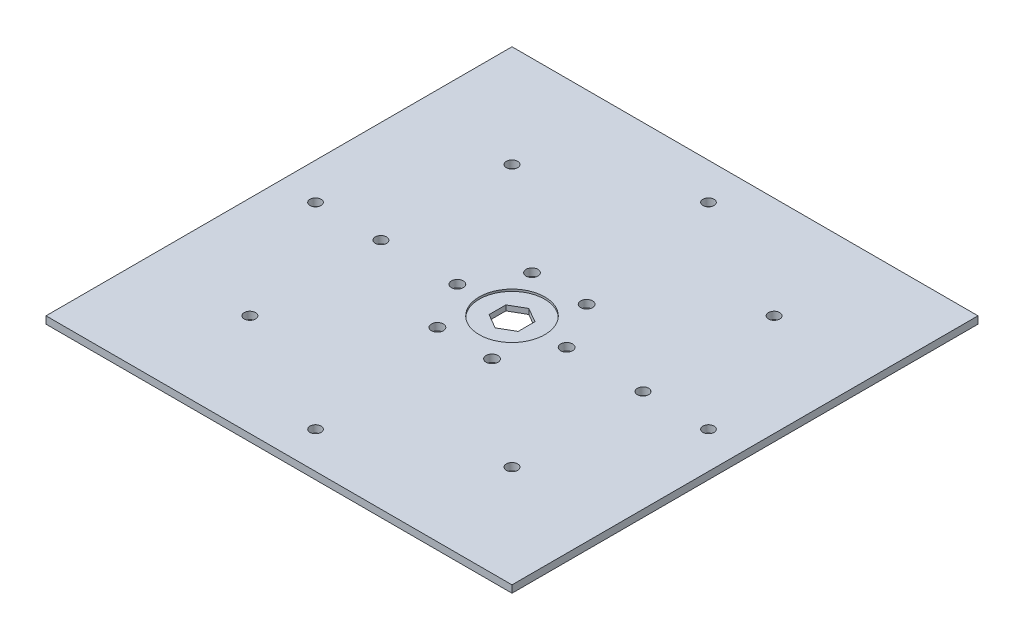
ISO-10303-21;
HEADER;
FILE_DESCRIPTION(('STEP AP214'),'2;1');
FILE_NAME('part.step','',(''),(''),'','','');
FILE_SCHEMA(('AUTOMOTIVE_DESIGN { 1 0 10303 214 1 1 1 1 }'));
ENDSEC;
DATA;
#1=APPLICATION_CONTEXT('core data for automotive mechanical design processes');
#2=APPLICATION_PROTOCOL_DEFINITION('international standard','automotive_design',2000,#1);
#3=PRODUCT_CONTEXT('',#1,'mechanical');
#4=PRODUCT('Part','Part','',(#3));
#5=PRODUCT_RELATED_PRODUCT_CATEGORY('part','',(#4));
#6=PRODUCT_DEFINITION_FORMATION('','',#4);
#7=PRODUCT_DEFINITION_CONTEXT('part definition',#1,'design');
#8=PRODUCT_DEFINITION('design','',#6,#7);
#9=PRODUCT_DEFINITION_SHAPE('','',#8);
#10=(LENGTH_UNIT() NAMED_UNIT(*) SI_UNIT(.MILLI.,.METRE.));
#11=(NAMED_UNIT(*) PLANE_ANGLE_UNIT() SI_UNIT($,.RADIAN.));
#12=(NAMED_UNIT(*) SI_UNIT($,.STERADIAN.) SOLID_ANGLE_UNIT());
#13=UNCERTAINTY_MEASURE_WITH_UNIT(LENGTH_MEASURE(1.E-05),#10,'distance_accuracy_value','');
#14=(GEOMETRIC_REPRESENTATION_CONTEXT(3) GLOBAL_UNCERTAINTY_ASSIGNED_CONTEXT((#13)) GLOBAL_UNIT_ASSIGNED_CONTEXT((#10,
#11,#12)) REPRESENTATION_CONTEXT('',''));
#15=CARTESIAN_POINT('',(0.,0.,0.));
#16=DIRECTION('',(0.,0.,1.));
#17=DIRECTION('',(1.,0.,0.));
#18=AXIS2_PLACEMENT_3D('',#15,#16,#17);
#19=CARTESIAN_POINT('',(107.95,3.175,-97.9338257906459));
#20=DIRECTION('',(-1.,0.,0.));
#21=DIRECTION('',(0.,0.,1.));
#22=AXIS2_PLACEMENT_3D('',#19,#20,#21);
#23=PLANE('',#22);
#24=DIRECTION('',(0.,-1.,0.));
#25=VECTOR('',#24,1.);
#26=CARTESIAN_POINT('',(107.95,3.175,-97.9338257906459));
#27=LINE('',#26,#25);
#28=CARTESIAN_POINT('',(107.95,2.286,-97.9338257906459));
#29=VERTEX_POINT('',#28);
#30=CARTESIAN_POINT('',(107.95,0.,-97.9338257906459));
#31=VERTEX_POINT('',#30);
#32=EDGE_CURVE('E56',#29,#31,#27,.T.);
#33=ORIENTED_EDGE('',*,*,#32,.F.);
#34=DIRECTION('',(0.,0.,-1.));
#35=VECTOR('',#34,1.);
#36=CARTESIAN_POINT('',(107.95,2.286,-97.9338257906459));
#37=LINE('',#36,#35);
#38=CARTESIAN_POINT('',(107.95,2.286,-105.266174209354));
#39=VERTEX_POINT('',#38);
#40=EDGE_CURVE('E50',#29,#39,#37,.T.);
#41=ORIENTED_EDGE('',*,*,#40,.T.);
#42=DIRECTION('',(0.,-1.,0.));
#43=VECTOR('',#42,1.);
#44=CARTESIAN_POINT('',(107.95,3.175,-105.266174209354));
#45=LINE('',#44,#43);
#46=CARTESIAN_POINT('',(107.95,0.,-105.266174209354));
#47=VERTEX_POINT('',#46);
#48=EDGE_CURVE('E137',#39,#47,#45,.T.);
#49=ORIENTED_EDGE('',*,*,#48,.T.);
#50=DIRECTION('',(0.,0.,-1.));
#51=VECTOR('',#50,1.);
#52=CARTESIAN_POINT('',(107.95,0.,-97.9338257906459));
#53=LINE('',#52,#51);
#54=EDGE_CURVE('E309',#31,#47,#53,.T.);
#55=ORIENTED_EDGE('',*,*,#54,.F.);
#56=EDGE_LOOP('',(#33,#41,#49,#55));
#57=FACE_BOUND('',#56,.T.);
#58=ADVANCED_FACE('F35',(#57),#23,.T.);
#59=CARTESIAN_POINT('',(107.95,3.175,-105.266174209354));
#60=DIRECTION('',(-0.5,0.,0.866025403784439));
#61=DIRECTION('',(0.866025403784439,0.,0.5));
#62=AXIS2_PLACEMENT_3D('',#59,#60,#61);
#63=PLANE('',#62);
#64=ORIENTED_EDGE('',*,*,#48,.F.);
#65=DIRECTION('',(-0.866025403784439,0.,-0.5));
#66=VECTOR('',#65,1.);
#67=CARTESIAN_POINT('',(107.95,2.286,-105.266174209354));
#68=LINE('',#67,#66);
#69=CARTESIAN_POINT('',(101.6,2.286,-108.932348418708));
#70=VERTEX_POINT('',#69);
#71=EDGE_CURVE('E334',#39,#70,#68,.T.);
#72=ORIENTED_EDGE('',*,*,#71,.T.);
#73=DIRECTION('',(0.,-1.,0.));
#74=VECTOR('',#73,1.);
#75=CARTESIAN_POINT('',(101.6,3.175,-108.932348418708));
#76=LINE('',#75,#74);
#77=CARTESIAN_POINT('',(101.6,0.,-108.932348418708));
#78=VERTEX_POINT('',#77);
#79=EDGE_CURVE('E135',#70,#78,#76,.T.);
#80=ORIENTED_EDGE('',*,*,#79,.T.);
#81=DIRECTION('',(-0.866025403784439,0.,-0.5));
#82=VECTOR('',#81,1.);
#83=CARTESIAN_POINT('',(107.95,0.,-105.266174209354));
#84=LINE('',#83,#82);
#85=EDGE_CURVE('E314',#47,#78,#84,.T.);
#86=ORIENTED_EDGE('',*,*,#85,.F.);
#87=EDGE_LOOP('',(#64,#72,#80,#86));
#88=FACE_BOUND('',#87,.T.);
#89=ADVANCED_FACE('F343',(#88),#63,.T.);
#90=CARTESIAN_POINT('',(101.6,3.175,-108.932348418708));
#91=DIRECTION('',(0.499999999999998,0.,0.86602540378444));
#92=DIRECTION('',(0.86602540378444,0.,-0.499999999999998));
#93=AXIS2_PLACEMENT_3D('',#90,#91,#92);
#94=PLANE('',#93);
#95=ORIENTED_EDGE('',*,*,#79,.F.);
#96=DIRECTION('',(-0.86602540378444,0.,0.499999999999998));
#97=VECTOR('',#96,1.);
#98=CARTESIAN_POINT('',(101.6,2.286,-108.932348418708));
#99=LINE('',#98,#97);
#100=CARTESIAN_POINT('',(95.25,2.286,-105.266174209354));
#101=VERTEX_POINT('',#100);
#102=EDGE_CURVE('E332',#70,#101,#99,.T.);
#103=ORIENTED_EDGE('',*,*,#102,.T.);
#104=DIRECTION('',(0.,-1.,0.));
#105=VECTOR('',#104,1.);
#106=CARTESIAN_POINT('',(95.25,3.175,-105.266174209354));
#107=LINE('',#106,#105);
#108=CARTESIAN_POINT('',(95.25,0.,-105.266174209354));
#109=VERTEX_POINT('',#108);
#110=EDGE_CURVE('E129',#101,#109,#107,.T.);
#111=ORIENTED_EDGE('',*,*,#110,.T.);
#112=DIRECTION('',(-0.86602540378444,0.,0.499999999999998));
#113=VECTOR('',#112,1.);
#114=CARTESIAN_POINT('',(101.6,0.,-108.932348418708));
#115=LINE('',#114,#113);
#116=EDGE_CURVE('E317',#78,#109,#115,.T.);
#117=ORIENTED_EDGE('',*,*,#116,.F.);
#118=EDGE_LOOP('',(#95,#103,#111,#117));
#119=FACE_BOUND('',#118,.T.);
#120=ADVANCED_FACE('F345',(#119),#94,.T.);
#121=CARTESIAN_POINT('',(95.25,3.175,-105.266174209354));
#122=DIRECTION('',(1.,0.,0.));
#123=DIRECTION('',(0.,0.,-1.));
#124=AXIS2_PLACEMENT_3D('',#121,#122,#123);
#125=PLANE('',#124);
#126=ORIENTED_EDGE('',*,*,#110,.F.);
#127=DIRECTION('',(0.,0.,1.));
#128=VECTOR('',#127,1.);
#129=CARTESIAN_POINT('',(95.25,2.286,-105.266174209354));
#130=LINE('',#129,#128);
#131=CARTESIAN_POINT('',(95.25,2.286,-97.9338257906459));
#132=VERTEX_POINT('',#131);
#133=EDGE_CURVE('E121',#101,#132,#130,.T.);
#134=ORIENTED_EDGE('',*,*,#133,.T.);
#135=DIRECTION('',(0.,-1.,0.));
#136=VECTOR('',#135,1.);
#137=CARTESIAN_POINT('',(95.25,3.175,-97.9338257906459));
#138=LINE('',#137,#136);
#139=CARTESIAN_POINT('',(95.25,0.,-97.9338257906459));
#140=VERTEX_POINT('',#139);
#141=EDGE_CURVE('E120',#132,#140,#138,.T.);
#142=ORIENTED_EDGE('',*,*,#141,.T.);
#143=DIRECTION('',(0.,0.,1.));
#144=VECTOR('',#143,1.);
#145=CARTESIAN_POINT('',(95.25,0.,-105.266174209354));
#146=LINE('',#145,#144);
#147=EDGE_CURVE('E320',#109,#140,#146,.T.);
#148=ORIENTED_EDGE('',*,*,#147,.F.);
#149=EDGE_LOOP('',(#126,#134,#142,#148));
#150=FACE_BOUND('',#149,.T.);
#151=ADVANCED_FACE('F330',(#150),#125,.T.);
#152=CARTESIAN_POINT('',(95.25,3.175,-97.9338257906459));
#153=DIRECTION('',(0.499999999999998,0.,-0.86602540378444));
#154=DIRECTION('',(-0.86602540378444,0.,-0.499999999999998));
#155=AXIS2_PLACEMENT_3D('',#152,#153,#154);
#156=PLANE('',#155);
#157=ORIENTED_EDGE('',*,*,#141,.F.);
#158=DIRECTION('',(0.86602540378444,0.,0.499999999999998));
#159=VECTOR('',#158,1.);
#160=CARTESIAN_POINT('',(95.25,2.286,-97.9338257906459));
#161=LINE('',#160,#159);
#162=CARTESIAN_POINT('',(101.6,2.286,-94.2676515812917));
#163=VERTEX_POINT('',#162);
#164=EDGE_CURVE('E112',#132,#163,#161,.T.);
#165=ORIENTED_EDGE('',*,*,#164,.T.);
#166=DIRECTION('',(0.,-1.,0.));
#167=VECTOR('',#166,1.);
#168=CARTESIAN_POINT('',(101.6,3.175,-94.2676515812917));
#169=LINE('',#168,#167);
#170=CARTESIAN_POINT('',(101.6,0.,-94.2676515812917));
#171=VERTEX_POINT('',#170);
#172=EDGE_CURVE('E119',#163,#171,#169,.T.);
#173=ORIENTED_EDGE('',*,*,#172,.T.);
#174=DIRECTION('',(0.86602540378444,0.,0.499999999999998));
#175=VECTOR('',#174,1.);
#176=CARTESIAN_POINT('',(95.25,0.,-97.9338257906459));
#177=LINE('',#176,#175);
#178=EDGE_CURVE('E323',#140,#171,#177,.T.);
#179=ORIENTED_EDGE('',*,*,#178,.F.);
#180=EDGE_LOOP('',(#157,#165,#173,#179));
#181=FACE_BOUND('',#180,.T.);
#182=ADVANCED_FACE('F117',(#181),#156,.T.);
#183=CARTESIAN_POINT('',(101.6,3.175,-94.2676515812917));
#184=DIRECTION('',(-0.5,0.,-0.866025403784439));
#185=DIRECTION('',(-0.866025403784439,0.,0.5));
#186=AXIS2_PLACEMENT_3D('',#183,#184,#185);
#187=PLANE('',#186);
#188=ORIENTED_EDGE('',*,*,#172,.F.);
#189=DIRECTION('',(0.866025403784439,0.,-0.5));
#190=VECTOR('',#189,1.);
#191=CARTESIAN_POINT('',(101.6,2.286,-94.2676515812917));
#192=LINE('',#191,#190);
#193=EDGE_CURVE('E11',#163,#29,#192,.T.);
#194=ORIENTED_EDGE('',*,*,#193,.T.);
#195=ORIENTED_EDGE('',*,*,#32,.T.);
#196=DIRECTION('',(0.866025403784439,0.,-0.5));
#197=VECTOR('',#196,1.);
#198=CARTESIAN_POINT('',(101.6,0.,-94.2676515812917));
#199=LINE('',#198,#197);
#200=EDGE_CURVE('E126',#171,#31,#199,.T.);
#201=ORIENTED_EDGE('',*,*,#200,.F.);
#202=EDGE_LOOP('',(#188,#194,#195,#201));
#203=FACE_BOUND('',#202,.T.);
#204=ADVANCED_FACE('F124',(#203),#187,.T.);
#205=CARTESIAN_POINT('',(0.,3.175,0.));
#206=DIRECTION('',(0.,-1.,0.));
#207=DIRECTION('',(0.,0.,-1.));
#208=AXIS2_PLACEMENT_3D('',#205,#206,#207);
#209=PLANE('',#208);
#210=CARTESIAN_POINT('',(101.6,3.175,-101.6));
#211=DIRECTION('',(0.,1.,0.));
#212=DIRECTION('',(0.,0.,1.));
#213=AXIS2_PLACEMENT_3D('',#210,#211,#212);
#214=CIRCLE('',#213,14.2875);
#215=CARTESIAN_POINT('',(101.6,3.175,-87.3125));
#216=VERTEX_POINT('',#215);
#217=EDGE_CURVE('E618',#216,#216,#214,.T.);
#218=ORIENTED_EDGE('',*,*,#217,.F.);
#219=EDGE_LOOP('',(#218));
#220=FACE_BOUND('',#219,.T.);
#221=CARTESIAN_POINT('',(158.75,3.175,-158.75));
#222=DIRECTION('',(0.,1.,0.));
#223=DIRECTION('',(0.,0.,-1.));
#224=AXIS2_PLACEMENT_3D('',#221,#222,#223);
#225=CIRCLE('',#224,2.45744999999999);
#226=CARTESIAN_POINT('',(158.75,3.175,-161.20745));
#227=VERTEX_POINT('',#226);
#228=EDGE_CURVE('E140',#227,#227,#225,.T.);
#229=ORIENTED_EDGE('',*,*,#228,.F.);
#230=EDGE_LOOP('',(#229));
#231=FACE_BOUND('',#230,.T.);
#232=CARTESIAN_POINT('',(158.75,3.175,-101.6));
#233=DIRECTION('',(0.,1.,0.));
#234=DIRECTION('',(0.,0.,-1.));
#235=AXIS2_PLACEMENT_3D('',#232,#233,#234);
#236=CIRCLE('',#235,2.45745000000001);
#237=CARTESIAN_POINT('',(158.75,3.175,-104.05745));
#238=VERTEX_POINT('',#237);
#239=EDGE_CURVE('E146',#238,#238,#236,.T.);
#240=ORIENTED_EDGE('',*,*,#239,.F.);
#241=EDGE_LOOP('',(#240));
#242=FACE_BOUND('',#241,.T.);
#243=CARTESIAN_POINT('',(158.75,3.175,-44.45));
#244=DIRECTION('',(0.,1.,0.));
#245=DIRECTION('',(0.,0.,-1.));
#246=AXIS2_PLACEMENT_3D('',#243,#244,#245);
#247=CIRCLE('',#246,2.45744999999998);
#248=CARTESIAN_POINT('',(158.75,3.175,-46.90745));
#249=VERTEX_POINT('',#248);
#250=EDGE_CURVE('E152',#249,#249,#247,.T.);
#251=ORIENTED_EDGE('',*,*,#250,.F.);
#252=EDGE_LOOP('',(#251));
#253=FACE_BOUND('',#252,.T.);
#254=CARTESIAN_POINT('',(44.45,3.175,-44.45));
#255=DIRECTION('',(0.,1.,0.));
#256=DIRECTION('',(0.,0.,1.));
#257=AXIS2_PLACEMENT_3D('',#254,#255,#256);
#258=CIRCLE('',#257,2.45745);
#259=CARTESIAN_POINT('',(44.45,3.175,-41.99255));
#260=VERTEX_POINT('',#259);
#261=EDGE_CURVE('E158',#260,#260,#258,.T.);
#262=ORIENTED_EDGE('',*,*,#261,.F.);
#263=EDGE_LOOP('',(#262));
#264=FACE_BOUND('',#263,.T.);
#265=CARTESIAN_POINT('',(44.45,3.175,-101.6));
#266=DIRECTION('',(0.,1.,0.));
#267=DIRECTION('',(0.,0.,1.));
#268=AXIS2_PLACEMENT_3D('',#265,#266,#267);
#269=CIRCLE('',#268,2.45745);
#270=CARTESIAN_POINT('',(44.45,3.175,-99.14255));
#271=VERTEX_POINT('',#270);
#272=EDGE_CURVE('E164',#271,#271,#269,.T.);
#273=ORIENTED_EDGE('',*,*,#272,.F.);
#274=EDGE_LOOP('',(#273));
#275=FACE_BOUND('',#274,.T.);
#276=CARTESIAN_POINT('',(44.45,3.175,-158.75));
#277=DIRECTION('',(0.,1.,0.));
#278=DIRECTION('',(0.,0.,1.));
#279=AXIS2_PLACEMENT_3D('',#276,#277,#278);
#280=CIRCLE('',#279,2.45745);
#281=CARTESIAN_POINT('',(44.45,3.175,-156.29255));
#282=VERTEX_POINT('',#281);
#283=EDGE_CURVE('E170',#282,#282,#280,.T.);
#284=ORIENTED_EDGE('',*,*,#283,.F.);
#285=EDGE_LOOP('',(#284));
#286=FACE_BOUND('',#285,.T.);
#287=DIRECTION('',(0.,0.,1.));
#288=VECTOR('',#287,1.);
#289=CARTESIAN_POINT('',(0.,3.175,0.));
#290=LINE('',#289,#288);
#291=CARTESIAN_POINT('',(0.,3.175,-203.2));
#292=VERTEX_POINT('',#291);
#293=CARTESIAN_POINT('',(0.,3.175,0.));
#294=VERTEX_POINT('',#293);
#295=EDGE_CURVE('E176',#292,#294,#290,.T.);
#296=ORIENTED_EDGE('',*,*,#295,.T.);
#297=DIRECTION('',(1.,0.,0.));
#298=VECTOR('',#297,1.);
#299=CARTESIAN_POINT('',(0.,3.175,0.));
#300=LINE('',#299,#298);
#301=CARTESIAN_POINT('',(203.2,3.175,0.));
#302=VERTEX_POINT('',#301);
#303=EDGE_CURVE('E179',#294,#302,#300,.T.);
#304=ORIENTED_EDGE('',*,*,#303,.T.);
#305=DIRECTION('',(0.,0.,-1.));
#306=VECTOR('',#305,1.);
#307=CARTESIAN_POINT('',(203.2,3.175,0.));
#308=LINE('',#307,#306);
#309=CARTESIAN_POINT('',(203.2,3.175,-203.2));
#310=VERTEX_POINT('',#309);
#311=EDGE_CURVE('E182',#302,#310,#308,.T.);
#312=ORIENTED_EDGE('',*,*,#311,.T.);
#313=DIRECTION('',(-1.,0.,0.));
#314=VECTOR('',#313,1.);
#315=CARTESIAN_POINT('',(0.,3.175,-203.2));
#316=LINE('',#315,#314);
#317=EDGE_CURVE('E184',#310,#292,#316,.T.);
#318=ORIENTED_EDGE('',*,*,#317,.T.);
#319=EDGE_LOOP('',(#296,#304,#312,#318));
#320=FACE_BOUND('',#319,.T.);
#321=CARTESIAN_POINT('',(77.7875,3.175,-101.6));
#322=DIRECTION('',(0.,1.,0.));
#323=DIRECTION('',(0.,0.,1.));
#324=AXIS2_PLACEMENT_3D('',#321,#322,#323);
#325=CIRCLE('',#324,2.5908);
#326=CARTESIAN_POINT('',(77.7875,3.175,-99.0092));
#327=VERTEX_POINT('',#326);
#328=EDGE_CURVE('E231',#327,#327,#325,.T.);
#329=ORIENTED_EDGE('',*,*,#328,.F.);
#330=EDGE_LOOP('',(#329));
#331=FACE_BOUND('',#330,.T.);
#332=CARTESIAN_POINT('',(89.6937500000001,3.175,-122.222229927617));
#333=DIRECTION('',(0.,1.,0.));
#334=DIRECTION('',(0.,0.,1.));
#335=AXIS2_PLACEMENT_3D('',#332,#333,#334);
#336=CIRCLE('',#335,2.59079999999999);
#337=CARTESIAN_POINT('',(89.6937500000001,3.175,-119.631429927617));
#338=VERTEX_POINT('',#337);
#339=EDGE_CURVE('E235',#338,#338,#336,.T.);
#340=ORIENTED_EDGE('',*,*,#339,.F.);
#341=EDGE_LOOP('',(#340));
#342=FACE_BOUND('',#341,.T.);
#343=CARTESIAN_POINT('',(89.6937500000001,3.175,-80.977770072383));
#344=DIRECTION('',(0.,1.,0.));
#345=DIRECTION('',(0.,0.,1.));
#346=AXIS2_PLACEMENT_3D('',#343,#344,#345);
#347=CIRCLE('',#346,2.59080000000004);
#348=CARTESIAN_POINT('',(89.6937500000001,3.175,-78.386970072383));
#349=VERTEX_POINT('',#348);
#350=EDGE_CURVE('E239',#349,#349,#347,.T.);
#351=ORIENTED_EDGE('',*,*,#350,.F.);
#352=EDGE_LOOP('',(#351));
#353=FACE_BOUND('',#352,.T.);
#354=CARTESIAN_POINT('',(113.50625,3.175,-122.222229927617));
#355=DIRECTION('',(0.,1.,0.));
#356=DIRECTION('',(0.,0.,1.));
#357=AXIS2_PLACEMENT_3D('',#354,#355,#356);
#358=CIRCLE('',#357,2.59080000000004);
#359=CARTESIAN_POINT('',(113.50625,3.175,-119.631429927617));
#360=VERTEX_POINT('',#359);
#361=EDGE_CURVE('E243',#360,#360,#358,.T.);
#362=ORIENTED_EDGE('',*,*,#361,.F.);
#363=EDGE_LOOP('',(#362));
#364=FACE_BOUND('',#363,.T.);
#365=CARTESIAN_POINT('',(125.4125,3.175,-101.6));
#366=DIRECTION('',(0.,1.,0.));
#367=DIRECTION('',(0.,0.,1.));
#368=AXIS2_PLACEMENT_3D('',#365,#366,#367);
#369=CIRCLE('',#368,2.59080000000002);
#370=CARTESIAN_POINT('',(125.4125,3.175,-99.0092));
#371=VERTEX_POINT('',#370);
#372=EDGE_CURVE('E247',#371,#371,#369,.T.);
#373=ORIENTED_EDGE('',*,*,#372,.F.);
#374=EDGE_LOOP('',(#373));
#375=FACE_BOUND('',#374,.T.);
#376=CARTESIAN_POINT('',(113.50625,3.175,-80.977770072383));
#377=DIRECTION('',(0.,1.,0.));
#378=DIRECTION('',(0.,0.,1.));
#379=AXIS2_PLACEMENT_3D('',#376,#377,#378);
#380=CIRCLE('',#379,2.59080000000005);
#381=CARTESIAN_POINT('',(113.50625,3.175,-78.386970072383));
#382=VERTEX_POINT('',#381);
#383=EDGE_CURVE('E251',#382,#382,#380,.T.);
#384=ORIENTED_EDGE('',*,*,#383,.F.);
#385=EDGE_LOOP('',(#384));
#386=FACE_BOUND('',#385,.T.);
#387=CARTESIAN_POINT('',(101.6,3.175,-187.271643395));
#388=DIRECTION('',(0.,1.,0.));
#389=DIRECTION('',(0.,0.,1.));
#390=AXIS2_PLACEMENT_3D('',#387,#388,#389);
#391=CIRCLE('',#390,2.413);
#392=CARTESIAN_POINT('',(101.6,3.175,-184.858643395));
#393=VERTEX_POINT('',#392);
#394=EDGE_CURVE('E255',#393,#393,#391,.T.);
#395=ORIENTED_EDGE('',*,*,#394,.F.);
#396=EDGE_LOOP('',(#395));
#397=FACE_BOUND('',#396,.T.);
#398=CARTESIAN_POINT('',(187.271643395,3.175,-101.6));
#399=DIRECTION('',(0.,1.,0.));
#400=DIRECTION('',(0.,0.,1.));
#401=AXIS2_PLACEMENT_3D('',#398,#399,#400);
#402=CIRCLE('',#401,2.41300000000009);
#403=CARTESIAN_POINT('',(187.271643395,3.175,-99.1869999999995));
#404=VERTEX_POINT('',#403);
#405=EDGE_CURVE('E259',#404,#404,#402,.T.);
#406=ORIENTED_EDGE('',*,*,#405,.F.);
#407=EDGE_LOOP('',(#406));
#408=FACE_BOUND('',#407,.T.);
#409=CARTESIAN_POINT('',(101.6,3.175,-15.9283566049997));
#410=DIRECTION('',(0.,1.,0.));
#411=DIRECTION('',(0.,0.,1.));
#412=AXIS2_PLACEMENT_3D('',#409,#410,#411);
#413=CIRCLE('',#412,2.4130000000001);
#414=CARTESIAN_POINT('',(101.6,3.175,-13.5153566049996));
#415=VERTEX_POINT('',#414);
#416=EDGE_CURVE('E263',#415,#415,#413,.T.);
#417=ORIENTED_EDGE('',*,*,#416,.F.);
#418=EDGE_LOOP('',(#417));
#419=FACE_BOUND('',#418,.T.);
#420=CARTESIAN_POINT('',(15.9283566050004,3.175,-101.6));
#421=DIRECTION('',(0.,1.,0.));
#422=DIRECTION('',(0.,0.,1.));
#423=AXIS2_PLACEMENT_3D('',#420,#421,#422);
#424=CIRCLE('',#423,2.413);
#425=CARTESIAN_POINT('',(15.9283566050004,3.175,-99.187));
#426=VERTEX_POINT('',#425);
#427=EDGE_CURVE('E266',#426,#426,#424,.T.);
#428=ORIENTED_EDGE('',*,*,#427,.F.);
#429=EDGE_LOOP('',(#428));
#430=FACE_BOUND('',#429,.T.);
#431=ADVANCED_FACE('F223',(#220,#231,#242,#253,#264,#275,#286,#320,#331,#342,#353,#364,#375,
#386,#397,#408,#419,#430),#209,.F.);
#432=CARTESIAN_POINT('',(0.,0.,0.));
#433=DIRECTION('',(0.,-1.,0.));
#434=DIRECTION('',(0.,0.,-1.));
#435=AXIS2_PLACEMENT_3D('',#432,#433,#434);
#436=PLANE('',#435);
#437=CARTESIAN_POINT('',(101.6,0.,-15.9283566049997));
#438=DIRECTION('',(0.,1.,0.));
#439=DIRECTION('',(0.,0.,1.));
#440=AXIS2_PLACEMENT_3D('',#437,#438,#439);
#441=CIRCLE('',#440,2.4130000000001);
#442=CARTESIAN_POINT('',(101.6,0.,-13.5153566049996));
#443=VERTEX_POINT('',#442);
#444=EDGE_CURVE('E268',#443,#443,#441,.T.);
#445=ORIENTED_EDGE('',*,*,#444,.T.);
#446=EDGE_LOOP('',(#445));
#447=FACE_BOUND('',#446,.T.);
#448=CARTESIAN_POINT('',(101.6,0.,-187.271643395));
#449=DIRECTION('',(0.,1.,0.));
#450=DIRECTION('',(0.,0.,1.));
#451=AXIS2_PLACEMENT_3D('',#448,#449,#450);
#452=CIRCLE('',#451,2.413);
#453=CARTESIAN_POINT('',(101.6,0.,-184.858643395));
#454=VERTEX_POINT('',#453);
#455=EDGE_CURVE('E281',#454,#454,#452,.T.);
#456=ORIENTED_EDGE('',*,*,#455,.T.);
#457=EDGE_LOOP('',(#456));
#458=FACE_BOUND('',#457,.T.);
#459=CARTESIAN_POINT('',(125.4125,0.,-101.6));
#460=DIRECTION('',(0.,1.,0.));
#461=DIRECTION('',(0.,0.,1.));
#462=AXIS2_PLACEMENT_3D('',#459,#460,#461);
#463=CIRCLE('',#462,2.59080000000002);
#464=CARTESIAN_POINT('',(125.4125,0.,-99.0092));
#465=VERTEX_POINT('',#464);
#466=EDGE_CURVE('E289',#465,#465,#463,.T.);
#467=ORIENTED_EDGE('',*,*,#466,.T.);
#468=EDGE_LOOP('',(#467));
#469=FACE_BOUND('',#468,.T.);
#470=CARTESIAN_POINT('',(89.6937500000001,0.,-80.977770072383));
#471=DIRECTION('',(0.,1.,0.));
#472=DIRECTION('',(0.,0.,1.));
#473=AXIS2_PLACEMENT_3D('',#470,#471,#472);
#474=CIRCLE('',#473,2.59080000000004);
#475=CARTESIAN_POINT('',(89.6937500000001,0.,-78.386970072383));
#476=VERTEX_POINT('',#475);
#477=EDGE_CURVE('E297',#476,#476,#474,.T.);
#478=ORIENTED_EDGE('',*,*,#477,.T.);
#479=EDGE_LOOP('',(#478));
#480=FACE_BOUND('',#479,.T.);
#481=CARTESIAN_POINT('',(77.7875,0.,-101.6));
#482=DIRECTION('',(0.,1.,0.));
#483=DIRECTION('',(0.,0.,1.));
#484=AXIS2_PLACEMENT_3D('',#481,#482,#483);
#485=CIRCLE('',#484,2.5908);
#486=CARTESIAN_POINT('',(77.7875,0.,-99.0092));
#487=VERTEX_POINT('',#486);
#488=EDGE_CURVE('E305',#487,#487,#485,.T.);
#489=ORIENTED_EDGE('',*,*,#488,.T.);
#490=EDGE_LOOP('',(#489));
#491=FACE_BOUND('',#490,.T.);
#492=CARTESIAN_POINT('',(158.75,0.,-101.6));
#493=DIRECTION('',(0.,1.,0.));
#494=DIRECTION('',(0.,0.,-1.));
#495=AXIS2_PLACEMENT_3D('',#492,#493,#494);
#496=CIRCLE('',#495,2.45745000000001);
#497=CARTESIAN_POINT('',(158.75,0.,-104.05745));
#498=VERTEX_POINT('',#497);
#499=EDGE_CURVE('E143',#498,#498,#496,.T.);
#500=ORIENTED_EDGE('',*,*,#499,.T.);
#501=EDGE_LOOP('',(#500));
#502=FACE_BOUND('',#501,.T.);
#503=CARTESIAN_POINT('',(44.45,0.,-44.45));
#504=DIRECTION('',(0.,1.,0.));
#505=DIRECTION('',(0.,0.,1.));
#506=AXIS2_PLACEMENT_3D('',#503,#504,#505);
#507=CIRCLE('',#506,2.45745);
#508=CARTESIAN_POINT('',(44.45,0.,-41.99255));
#509=VERTEX_POINT('',#508);
#510=EDGE_CURVE('E155',#509,#509,#507,.T.);
#511=ORIENTED_EDGE('',*,*,#510,.T.);
#512=EDGE_LOOP('',(#511));
#513=FACE_BOUND('',#512,.T.);
#514=CARTESIAN_POINT('',(44.45,0.,-158.75));
#515=DIRECTION('',(0.,1.,0.));
#516=DIRECTION('',(0.,0.,1.));
#517=AXIS2_PLACEMENT_3D('',#514,#515,#516);
#518=CIRCLE('',#517,2.45745);
#519=CARTESIAN_POINT('',(44.45,0.,-156.29255));
#520=VERTEX_POINT('',#519);
#521=EDGE_CURVE('E167',#520,#520,#518,.T.);
#522=ORIENTED_EDGE('',*,*,#521,.T.);
#523=EDGE_LOOP('',(#522));
#524=FACE_BOUND('',#523,.T.);
#525=DIRECTION('',(0.,0.,1.));
#526=VECTOR('',#525,1.);
#527=CARTESIAN_POINT('',(0.,0.,0.));
#528=LINE('',#527,#526);
#529=CARTESIAN_POINT('',(0.,0.,-203.2));
#530=VERTEX_POINT('',#529);
#531=CARTESIAN_POINT('',(0.,0.,0.));
#532=VERTEX_POINT('',#531);
#533=EDGE_CURVE('E173',#530,#532,#528,.T.);
#534=ORIENTED_EDGE('',*,*,#533,.F.);
#535=DIRECTION('',(-1.,0.,0.));
#536=VECTOR('',#535,1.);
#537=CARTESIAN_POINT('',(0.,0.,-203.2));
#538=LINE('',#537,#536);
#539=CARTESIAN_POINT('',(203.2,0.,-203.2));
#540=VERTEX_POINT('',#539);
#541=EDGE_CURVE('E180',#540,#530,#538,.T.);
#542=ORIENTED_EDGE('',*,*,#541,.F.);
#543=DIRECTION('',(0.,0.,-1.));
#544=VECTOR('',#543,1.);
#545=CARTESIAN_POINT('',(203.2,0.,0.));
#546=LINE('',#545,#544);
#547=CARTESIAN_POINT('',(203.2,0.,0.));
#548=VERTEX_POINT('',#547);
#549=EDGE_CURVE('E191',#548,#540,#546,.T.);
#550=ORIENTED_EDGE('',*,*,#549,.F.);
#551=DIRECTION('',(1.,0.,0.));
#552=VECTOR('',#551,1.);
#553=CARTESIAN_POINT('',(0.,0.,0.));
#554=LINE('',#553,#552);
#555=EDGE_CURVE('E189',#532,#548,#554,.T.);
#556=ORIENTED_EDGE('',*,*,#555,.F.);
#557=EDGE_LOOP('',(#534,#542,#550,#556));
#558=FACE_BOUND('',#557,.T.);
#559=CARTESIAN_POINT('',(44.45,0.,-101.6));
#560=DIRECTION('',(0.,1.,0.));
#561=DIRECTION('',(0.,0.,1.));
#562=AXIS2_PLACEMENT_3D('',#559,#560,#561);
#563=CIRCLE('',#562,2.45745);
#564=CARTESIAN_POINT('',(44.45,0.,-99.14255));
#565=VERTEX_POINT('',#564);
#566=EDGE_CURVE('E161',#565,#565,#563,.T.);
#567=ORIENTED_EDGE('',*,*,#566,.T.);
#568=EDGE_LOOP('',(#567));
#569=FACE_BOUND('',#568,.T.);
#570=CARTESIAN_POINT('',(158.75,0.,-44.45));
#571=DIRECTION('',(0.,1.,0.));
#572=DIRECTION('',(0.,0.,-1.));
#573=AXIS2_PLACEMENT_3D('',#570,#571,#572);
#574=CIRCLE('',#573,2.45744999999998);
#575=CARTESIAN_POINT('',(158.75,0.,-46.90745));
#576=VERTEX_POINT('',#575);
#577=EDGE_CURVE('E149',#576,#576,#574,.T.);
#578=ORIENTED_EDGE('',*,*,#577,.T.);
#579=EDGE_LOOP('',(#578));
#580=FACE_BOUND('',#579,.T.);
#581=CARTESIAN_POINT('',(158.75,0.,-158.75));
#582=DIRECTION('',(0.,1.,0.));
#583=DIRECTION('',(0.,0.,-1.));
#584=AXIS2_PLACEMENT_3D('',#581,#582,#583);
#585=CIRCLE('',#584,2.45744999999999);
#586=CARTESIAN_POINT('',(158.75,0.,-161.20745));
#587=VERTEX_POINT('',#586);
#588=EDGE_CURVE('E139',#587,#587,#585,.T.);
#589=ORIENTED_EDGE('',*,*,#588,.T.);
#590=EDGE_LOOP('',(#589));
#591=FACE_BOUND('',#590,.T.);
#592=ORIENTED_EDGE('',*,*,#200,.T.);
#593=ORIENTED_EDGE('',*,*,#54,.T.);
#594=ORIENTED_EDGE('',*,*,#85,.T.);
#595=ORIENTED_EDGE('',*,*,#116,.T.);
#596=ORIENTED_EDGE('',*,*,#147,.T.);
#597=ORIENTED_EDGE('',*,*,#178,.T.);
#598=EDGE_LOOP('',(#592,#593,#594,#595,#596,#597));
#599=FACE_BOUND('',#598,.T.);
#600=CARTESIAN_POINT('',(89.6937500000001,0.,-122.222229927617));
#601=DIRECTION('',(0.,1.,0.));
#602=DIRECTION('',(0.,0.,1.));
#603=AXIS2_PLACEMENT_3D('',#600,#601,#602);
#604=CIRCLE('',#603,2.59079999999999);
#605=CARTESIAN_POINT('',(89.6937500000001,0.,-119.631429927617));
#606=VERTEX_POINT('',#605);
#607=EDGE_CURVE('E301',#606,#606,#604,.T.);
#608=ORIENTED_EDGE('',*,*,#607,.T.);
#609=EDGE_LOOP('',(#608));
#610=FACE_BOUND('',#609,.T.);
#611=CARTESIAN_POINT('',(113.50625,0.,-122.222229927617));
#612=DIRECTION('',(0.,1.,0.));
#613=DIRECTION('',(0.,0.,1.));
#614=AXIS2_PLACEMENT_3D('',#611,#612,#613);
#615=CIRCLE('',#614,2.59080000000004);
#616=CARTESIAN_POINT('',(113.50625,0.,-119.631429927617));
#617=VERTEX_POINT('',#616);
#618=EDGE_CURVE('E293',#617,#617,#615,.T.);
#619=ORIENTED_EDGE('',*,*,#618,.T.);
#620=EDGE_LOOP('',(#619));
#621=FACE_BOUND('',#620,.T.);
#622=CARTESIAN_POINT('',(113.50625,0.,-80.977770072383));
#623=DIRECTION('',(0.,1.,0.));
#624=DIRECTION('',(0.,0.,1.));
#625=AXIS2_PLACEMENT_3D('',#622,#623,#624);
#626=CIRCLE('',#625,2.59080000000005);
#627=CARTESIAN_POINT('',(113.50625,0.,-78.386970072383));
#628=VERTEX_POINT('',#627);
#629=EDGE_CURVE('E285',#628,#628,#626,.T.);
#630=ORIENTED_EDGE('',*,*,#629,.T.);
#631=EDGE_LOOP('',(#630));
#632=FACE_BOUND('',#631,.T.);
#633=CARTESIAN_POINT('',(187.271643395,0.,-101.6));
#634=DIRECTION('',(0.,1.,0.));
#635=DIRECTION('',(0.,0.,1.));
#636=AXIS2_PLACEMENT_3D('',#633,#634,#635);
#637=CIRCLE('',#636,2.41300000000009);
#638=CARTESIAN_POINT('',(187.271643395,0.,-99.1869999999995));
#639=VERTEX_POINT('',#638);
#640=EDGE_CURVE('E278',#639,#639,#637,.T.);
#641=ORIENTED_EDGE('',*,*,#640,.T.);
#642=EDGE_LOOP('',(#641));
#643=FACE_BOUND('',#642,.T.);
#644=CARTESIAN_POINT('',(15.9283566050004,0.,-101.6));
#645=DIRECTION('',(0.,1.,0.));
#646=DIRECTION('',(0.,0.,1.));
#647=AXIS2_PLACEMENT_3D('',#644,#645,#646);
#648=CIRCLE('',#647,2.413);
#649=CARTESIAN_POINT('',(15.9283566050004,0.,-99.187));
#650=VERTEX_POINT('',#649);
#651=EDGE_CURVE('E269',#650,#650,#648,.T.);
#652=ORIENTED_EDGE('',*,*,#651,.T.);
#653=EDGE_LOOP('',(#652));
#654=FACE_BOUND('',#653,.T.);
#655=ADVANCED_FACE('F212',(#447,#458,#469,#480,#491,#502,#513,#524,#558,#569,#580,#591,#599,
#610,#621,#632,#643,#654),#436,.T.);
#656=CARTESIAN_POINT('',(0.,3.175,0.));
#657=DIRECTION('',(1.,0.,0.));
#658=DIRECTION('',(0.,0.,-1.));
#659=AXIS2_PLACEMENT_3D('',#656,#657,#658);
#660=PLANE('',#659);
#661=ORIENTED_EDGE('',*,*,#533,.T.);
#662=DIRECTION('',(0.,-1.,0.));
#663=VECTOR('',#662,1.);
#664=CARTESIAN_POINT('',(0.,3.175,0.));
#665=LINE('',#664,#663);
#666=EDGE_CURVE('E43',#294,#532,#665,.T.);
#667=ORIENTED_EDGE('',*,*,#666,.F.);
#668=ORIENTED_EDGE('',*,*,#295,.F.);
#669=DIRECTION('',(0.,-1.,0.));
#670=VECTOR('',#669,1.);
#671=CARTESIAN_POINT('',(0.,3.175,-203.2));
#672=LINE('',#671,#670);
#673=EDGE_CURVE('E186',#292,#530,#672,.T.);
#674=ORIENTED_EDGE('',*,*,#673,.T.);
#675=EDGE_LOOP('',(#661,#667,#668,#674));
#676=FACE_BOUND('',#675,.T.);
#677=ADVANCED_FACE('F37',(#676),#660,.F.);
#678=CARTESIAN_POINT('',(0.,3.175,0.));
#679=DIRECTION('',(0.,0.,-1.));
#680=DIRECTION('',(-1.,0.,0.));
#681=AXIS2_PLACEMENT_3D('',#678,#679,#680);
#682=PLANE('',#681);
#683=ORIENTED_EDGE('',*,*,#555,.T.);
#684=DIRECTION('',(0.,-1.,0.));
#685=VECTOR('',#684,1.);
#686=CARTESIAN_POINT('',(203.2,3.175,0.));
#687=LINE('',#686,#685);
#688=EDGE_CURVE('E199',#302,#548,#687,.T.);
#689=ORIENTED_EDGE('',*,*,#688,.F.);
#690=ORIENTED_EDGE('',*,*,#303,.F.);
#691=ORIENTED_EDGE('',*,*,#666,.T.);
#692=EDGE_LOOP('',(#683,#689,#690,#691));
#693=FACE_BOUND('',#692,.T.);
#694=ADVANCED_FACE('F204',(#693),#682,.F.);
#695=CARTESIAN_POINT('',(203.2,3.175,0.));
#696=DIRECTION('',(-1.,0.,0.));
#697=DIRECTION('',(0.,0.,1.));
#698=AXIS2_PLACEMENT_3D('',#695,#696,#697);
#699=PLANE('',#698);
#700=ORIENTED_EDGE('',*,*,#549,.T.);
#701=DIRECTION('',(0.,-1.,0.));
#702=VECTOR('',#701,1.);
#703=CARTESIAN_POINT('',(203.2,3.175,-203.2));
#704=LINE('',#703,#702);
#705=EDGE_CURVE('E196',#310,#540,#704,.T.);
#706=ORIENTED_EDGE('',*,*,#705,.F.);
#707=ORIENTED_EDGE('',*,*,#311,.F.);
#708=ORIENTED_EDGE('',*,*,#688,.T.);
#709=EDGE_LOOP('',(#700,#706,#707,#708));
#710=FACE_BOUND('',#709,.T.);
#711=ADVANCED_FACE('F217',(#710),#699,.F.);
#712=CARTESIAN_POINT('',(0.,3.175,-203.2));
#713=DIRECTION('',(0.,0.,1.));
#714=DIRECTION('',(1.,0.,0.));
#715=AXIS2_PLACEMENT_3D('',#712,#713,#714);
#716=PLANE('',#715);
#717=ORIENTED_EDGE('',*,*,#541,.T.);
#718=ORIENTED_EDGE('',*,*,#673,.F.);
#719=ORIENTED_EDGE('',*,*,#317,.F.);
#720=ORIENTED_EDGE('',*,*,#705,.T.);
#721=EDGE_LOOP('',(#717,#718,#719,#720));
#722=FACE_BOUND('',#721,.T.);
#723=ADVANCED_FACE('F221',(#722),#716,.F.);
#724=CARTESIAN_POINT('',(44.45,3.175,-158.75));
#725=DIRECTION('',(0.,-1.,0.));
#726=DIRECTION('',(0.,0.,-1.));
#727=AXIS2_PLACEMENT_3D('',#724,#725,#726);
#728=CYLINDRICAL_SURFACE('',#727,2.45745);
#729=ORIENTED_EDGE('',*,*,#283,.T.);
#730=EDGE_LOOP('',(#729));
#731=FACE_BOUND('',#730,.T.);
#732=ORIENTED_EDGE('',*,*,#521,.F.);
#733=EDGE_LOOP('',(#732));
#734=FACE_BOUND('',#733,.T.);
#735=ADVANCED_FACE('F379',(#731,#734),#728,.F.);
#736=CARTESIAN_POINT('',(44.45,3.175,-101.6));
#737=DIRECTION('',(0.,-1.,0.));
#738=DIRECTION('',(0.,0.,-1.));
#739=AXIS2_PLACEMENT_3D('',#736,#737,#738);
#740=CYLINDRICAL_SURFACE('',#739,2.45745);
#741=ORIENTED_EDGE('',*,*,#272,.T.);
#742=EDGE_LOOP('',(#741));
#743=FACE_BOUND('',#742,.T.);
#744=ORIENTED_EDGE('',*,*,#566,.F.);
#745=EDGE_LOOP('',(#744));
#746=FACE_BOUND('',#745,.T.);
#747=ADVANCED_FACE('F375',(#743,#746),#740,.F.);
#748=CARTESIAN_POINT('',(44.45,3.175,-44.45));
#749=DIRECTION('',(0.,-1.,0.));
#750=DIRECTION('',(0.,0.,-1.));
#751=AXIS2_PLACEMENT_3D('',#748,#749,#750);
#752=CYLINDRICAL_SURFACE('',#751,2.45745);
#753=ORIENTED_EDGE('',*,*,#261,.T.);
#754=EDGE_LOOP('',(#753));
#755=FACE_BOUND('',#754,.T.);
#756=ORIENTED_EDGE('',*,*,#510,.F.);
#757=EDGE_LOOP('',(#756));
#758=FACE_BOUND('',#757,.T.);
#759=ADVANCED_FACE('F371',(#755,#758),#752,.F.);
#760=CARTESIAN_POINT('',(158.75,3.175,-44.45));
#761=DIRECTION('',(0.,-1.,0.));
#762=DIRECTION('',(0.,0.,-1.));
#763=AXIS2_PLACEMENT_3D('',#760,#761,#762);
#764=CYLINDRICAL_SURFACE('',#763,2.45744999999998);
#765=ORIENTED_EDGE('',*,*,#250,.T.);
#766=EDGE_LOOP('',(#765));
#767=FACE_BOUND('',#766,.T.);
#768=ORIENTED_EDGE('',*,*,#577,.F.);
#769=EDGE_LOOP('',(#768));
#770=FACE_BOUND('',#769,.T.);
#771=ADVANCED_FACE('F367',(#767,#770),#764,.F.);
#772=CARTESIAN_POINT('',(158.75,3.175,-101.6));
#773=DIRECTION('',(0.,-1.,0.));
#774=DIRECTION('',(0.,0.,-1.));
#775=AXIS2_PLACEMENT_3D('',#772,#773,#774);
#776=CYLINDRICAL_SURFACE('',#775,2.45745000000001);
#777=ORIENTED_EDGE('',*,*,#239,.T.);
#778=EDGE_LOOP('',(#777));
#779=FACE_BOUND('',#778,.T.);
#780=ORIENTED_EDGE('',*,*,#499,.F.);
#781=EDGE_LOOP('',(#780));
#782=FACE_BOUND('',#781,.T.);
#783=ADVANCED_FACE('F363',(#779,#782),#776,.F.);
#784=CARTESIAN_POINT('',(158.75,3.175,-158.75));
#785=DIRECTION('',(0.,-1.,0.));
#786=DIRECTION('',(0.,0.,-1.));
#787=AXIS2_PLACEMENT_3D('',#784,#785,#786);
#788=CYLINDRICAL_SURFACE('',#787,2.45744999999999);
#789=ORIENTED_EDGE('',*,*,#228,.T.);
#790=EDGE_LOOP('',(#789));
#791=FACE_BOUND('',#790,.T.);
#792=ORIENTED_EDGE('',*,*,#588,.F.);
#793=EDGE_LOOP('',(#792));
#794=FACE_BOUND('',#793,.T.);
#795=ADVANCED_FACE('F359',(#791,#794),#788,.F.);
#796=CARTESIAN_POINT('',(77.7875,3.175,-101.6));
#797=DIRECTION('',(0.,-1.,0.));
#798=DIRECTION('',(0.,0.,-1.));
#799=AXIS2_PLACEMENT_3D('',#796,#797,#798);
#800=CYLINDRICAL_SURFACE('',#799,2.5908);
#801=ORIENTED_EDGE('',*,*,#328,.T.);
#802=EDGE_LOOP('',(#801));
#803=FACE_BOUND('',#802,.T.);
#804=ORIENTED_EDGE('',*,*,#488,.F.);
#805=EDGE_LOOP('',(#804));
#806=FACE_BOUND('',#805,.T.);
#807=ADVANCED_FACE('F362',(#803,#806),#800,.F.);
#808=CARTESIAN_POINT('',(89.6937500000001,3.175,-122.222229927617));
#809=DIRECTION('',(0.,-1.,0.));
#810=DIRECTION('',(0.,0.,-1.));
#811=AXIS2_PLACEMENT_3D('',#808,#809,#810);
#812=CYLINDRICAL_SURFACE('',#811,2.59079999999999);
#813=ORIENTED_EDGE('',*,*,#339,.T.);
#814=EDGE_LOOP('',(#813));
#815=FACE_BOUND('',#814,.T.);
#816=ORIENTED_EDGE('',*,*,#607,.F.);
#817=EDGE_LOOP('',(#816));
#818=FACE_BOUND('',#817,.T.);
#819=ADVANCED_FACE('F517',(#815,#818),#812,.F.);
#820=CARTESIAN_POINT('',(89.6937500000001,3.175,-80.977770072383));
#821=DIRECTION('',(0.,-1.,0.));
#822=DIRECTION('',(0.,0.,-1.));
#823=AXIS2_PLACEMENT_3D('',#820,#821,#822);
#824=CYLINDRICAL_SURFACE('',#823,2.59080000000004);
#825=ORIENTED_EDGE('',*,*,#350,.T.);
#826=EDGE_LOOP('',(#825));
#827=FACE_BOUND('',#826,.T.);
#828=ORIENTED_EDGE('',*,*,#477,.F.);
#829=EDGE_LOOP('',(#828));
#830=FACE_BOUND('',#829,.T.);
#831=ADVANCED_FACE('F507',(#827,#830),#824,.F.);
#832=CARTESIAN_POINT('',(113.50625,3.175,-122.222229927617));
#833=DIRECTION('',(0.,-1.,0.));
#834=DIRECTION('',(0.,0.,-1.));
#835=AXIS2_PLACEMENT_3D('',#832,#833,#834);
#836=CYLINDRICAL_SURFACE('',#835,2.59080000000004);
#837=ORIENTED_EDGE('',*,*,#361,.T.);
#838=EDGE_LOOP('',(#837));
#839=FACE_BOUND('',#838,.T.);
#840=ORIENTED_EDGE('',*,*,#618,.F.);
#841=EDGE_LOOP('',(#840));
#842=FACE_BOUND('',#841,.T.);
#843=ADVANCED_FACE('F497',(#839,#842),#836,.F.);
#844=CARTESIAN_POINT('',(125.4125,3.175,-101.6));
#845=DIRECTION('',(0.,-1.,0.));
#846=DIRECTION('',(0.,0.,-1.));
#847=AXIS2_PLACEMENT_3D('',#844,#845,#846);
#848=CYLINDRICAL_SURFACE('',#847,2.59080000000002);
#849=ORIENTED_EDGE('',*,*,#372,.T.);
#850=EDGE_LOOP('',(#849));
#851=FACE_BOUND('',#850,.T.);
#852=ORIENTED_EDGE('',*,*,#466,.F.);
#853=EDGE_LOOP('',(#852));
#854=FACE_BOUND('',#853,.T.);
#855=ADVANCED_FACE('F487',(#851,#854),#848,.F.);
#856=CARTESIAN_POINT('',(113.50625,3.175,-80.977770072383));
#857=DIRECTION('',(0.,-1.,0.));
#858=DIRECTION('',(0.,0.,-1.));
#859=AXIS2_PLACEMENT_3D('',#856,#857,#858);
#860=CYLINDRICAL_SURFACE('',#859,2.59080000000005);
#861=ORIENTED_EDGE('',*,*,#383,.T.);
#862=EDGE_LOOP('',(#861));
#863=FACE_BOUND('',#862,.T.);
#864=ORIENTED_EDGE('',*,*,#629,.F.);
#865=EDGE_LOOP('',(#864));
#866=FACE_BOUND('',#865,.T.);
#867=ADVANCED_FACE('F477',(#863,#866),#860,.F.);
#868=CARTESIAN_POINT('',(101.6,3.175,-187.271643395));
#869=DIRECTION('',(0.,-1.,0.));
#870=DIRECTION('',(0.,0.,-1.));
#871=AXIS2_PLACEMENT_3D('',#868,#869,#870);
#872=CYLINDRICAL_SURFACE('',#871,2.413);
#873=ORIENTED_EDGE('',*,*,#394,.T.);
#874=EDGE_LOOP('',(#873));
#875=FACE_BOUND('',#874,.T.);
#876=ORIENTED_EDGE('',*,*,#455,.F.);
#877=EDGE_LOOP('',(#876));
#878=FACE_BOUND('',#877,.T.);
#879=ADVANCED_FACE('F467',(#875,#878),#872,.F.);
#880=CARTESIAN_POINT('',(187.271643395,3.175,-101.6));
#881=DIRECTION('',(0.,-1.,0.));
#882=DIRECTION('',(0.,0.,-1.));
#883=AXIS2_PLACEMENT_3D('',#880,#881,#882);
#884=CYLINDRICAL_SURFACE('',#883,2.41300000000009);
#885=ORIENTED_EDGE('',*,*,#405,.T.);
#886=EDGE_LOOP('',(#885));
#887=FACE_BOUND('',#886,.T.);
#888=ORIENTED_EDGE('',*,*,#640,.F.);
#889=EDGE_LOOP('',(#888));
#890=FACE_BOUND('',#889,.T.);
#891=ADVANCED_FACE('F457',(#887,#890),#884,.F.);
#892=CARTESIAN_POINT('',(101.6,3.175,-15.9283566049997));
#893=DIRECTION('',(0.,-1.,0.));
#894=DIRECTION('',(0.,0.,-1.));
#895=AXIS2_PLACEMENT_3D('',#892,#893,#894);
#896=CYLINDRICAL_SURFACE('',#895,2.4130000000001);
#897=ORIENTED_EDGE('',*,*,#416,.T.);
#898=EDGE_LOOP('',(#897));
#899=FACE_BOUND('',#898,.T.);
#900=ORIENTED_EDGE('',*,*,#444,.F.);
#901=EDGE_LOOP('',(#900));
#902=FACE_BOUND('',#901,.T.);
#903=ADVANCED_FACE('F447',(#899,#902),#896,.F.);
#904=CARTESIAN_POINT('',(15.9283566050004,3.175,-101.6));
#905=DIRECTION('',(0.,-1.,0.));
#906=DIRECTION('',(0.,0.,-1.));
#907=AXIS2_PLACEMENT_3D('',#904,#905,#906);
#908=CYLINDRICAL_SURFACE('',#907,2.413);
#909=ORIENTED_EDGE('',*,*,#427,.T.);
#910=EDGE_LOOP('',(#909));
#911=FACE_BOUND('',#910,.T.);
#912=ORIENTED_EDGE('',*,*,#651,.F.);
#913=EDGE_LOOP('',(#912));
#914=FACE_BOUND('',#913,.T.);
#915=ADVANCED_FACE('F441',(#911,#914),#908,.F.);
#916=CARTESIAN_POINT('',(101.6,2.286,-101.6));
#917=DIRECTION('',(0.,1.,0.));
#918=DIRECTION('',(0.,0.,1.));
#919=AXIS2_PLACEMENT_3D('',#916,#917,#918);
#920=CYLINDRICAL_SURFACE('',#919,14.2875);
#921=CARTESIAN_POINT('',(101.6,2.286,-101.6));
#922=DIRECTION('',(0.,1.,0.));
#923=DIRECTION('',(0.,0.,1.));
#924=AXIS2_PLACEMENT_3D('',#921,#922,#923);
#925=CIRCLE('',#924,14.2875);
#926=CARTESIAN_POINT('',(101.6,2.286,-87.3125));
#927=VERTEX_POINT('',#926);
#928=EDGE_CURVE('E122',#927,#927,#925,.T.);
#929=ORIENTED_EDGE('',*,*,#928,.F.);
#930=EDGE_LOOP('',(#929));
#931=FACE_BOUND('',#930,.T.);
#932=ORIENTED_EDGE('',*,*,#217,.T.);
#933=EDGE_LOOP('',(#932));
#934=FACE_BOUND('',#933,.T.);
#935=ADVANCED_FACE('F446',(#931,#934),#920,.F.);
#936=CARTESIAN_POINT('',(101.6,2.286,-101.6));
#937=DIRECTION('',(0.,1.,0.));
#938=DIRECTION('',(0.,0.,1.));
#939=AXIS2_PLACEMENT_3D('',#936,#937,#938);
#940=PLANE('',#939);
#941=ORIENTED_EDGE('',*,*,#193,.F.);
#942=ORIENTED_EDGE('',*,*,#164,.F.);
#943=ORIENTED_EDGE('',*,*,#133,.F.);
#944=ORIENTED_EDGE('',*,*,#102,.F.);
#945=ORIENTED_EDGE('',*,*,#71,.F.);
#946=ORIENTED_EDGE('',*,*,#40,.F.);
#947=EDGE_LOOP('',(#941,#942,#943,#944,#945,#946));
#948=FACE_BOUND('',#947,.T.);
#949=ORIENTED_EDGE('',*,*,#928,.T.);
#950=EDGE_LOOP('',(#949));
#951=FACE_BOUND('',#950,.T.);
#952=ADVANCED_FACE('F110',(#948,#951),#940,.T.);
#953=CLOSED_SHELL('',(#58,#89,#120,#151,#182,#204,#431,#655,#677,#694,#711,#723,#735,#747,#759,
#771,#783,#795,#807,#819,#831,#843,#855,#867,#879,#891,#903,#915,#935,#952));
#954=MANIFOLD_SOLID_BREP('B2',#953);
#955=ADVANCED_BREP_SHAPE_REPRESENTATION('',(#18,#954),#14);
#956=SHAPE_DEFINITION_REPRESENTATION(#9,#955);
ENDSEC;
END-ISO-10303-21;
